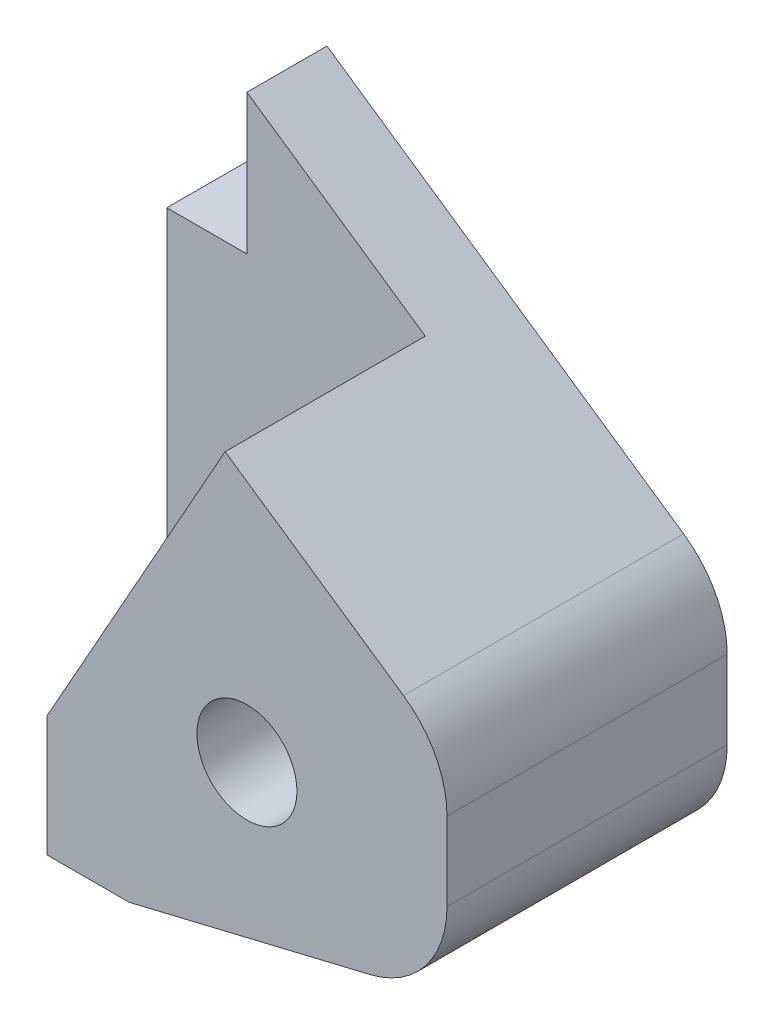
ISO-10303-21;
HEADER;
FILE_DESCRIPTION(('STEP AP214'),'2;1');
FILE_NAME('part.step','',(''),(''),'','','');
FILE_SCHEMA(('AUTOMOTIVE_DESIGN { 1 0 10303 214 1 1 1 1 }'));
ENDSEC;
DATA;
#1=APPLICATION_CONTEXT('core data for automotive mechanical design processes');
#2=APPLICATION_PROTOCOL_DEFINITION('international standard','automotive_design',2000,#1);
#3=PRODUCT_CONTEXT('',#1,'mechanical');
#4=PRODUCT('Part','Part','',(#3));
#5=PRODUCT_RELATED_PRODUCT_CATEGORY('part','',(#4));
#6=PRODUCT_DEFINITION_FORMATION('','',#4);
#7=PRODUCT_DEFINITION_CONTEXT('part definition',#1,'design');
#8=PRODUCT_DEFINITION('design','',#6,#7);
#9=PRODUCT_DEFINITION_SHAPE('','',#8);
#10=(LENGTH_UNIT() NAMED_UNIT(*) SI_UNIT(.MILLI.,.METRE.));
#11=(NAMED_UNIT(*) PLANE_ANGLE_UNIT() SI_UNIT($,.RADIAN.));
#12=(NAMED_UNIT(*) SI_UNIT($,.STERADIAN.) SOLID_ANGLE_UNIT());
#13=UNCERTAINTY_MEASURE_WITH_UNIT(LENGTH_MEASURE(1.E-05),#10,'distance_accuracy_value','');
#14=(GEOMETRIC_REPRESENTATION_CONTEXT(3) GLOBAL_UNCERTAINTY_ASSIGNED_CONTEXT((#13)) GLOBAL_UNIT_ASSIGNED_CONTEXT((#10,
#11,#12)) REPRESENTATION_CONTEXT('',''));
#15=CARTESIAN_POINT('',(0.,0.,0.));
#16=DIRECTION('',(0.,0.,1.));
#17=DIRECTION('',(1.,0.,0.));
#18=AXIS2_PLACEMENT_3D('',#15,#16,#17);
#19=CARTESIAN_POINT('',(0.,0.,4.));
#20=DIRECTION('',(0.,0.,1.));
#21=DIRECTION('',(1.,0.,0.));
#22=AXIS2_PLACEMENT_3D('',#19,#20,#21);
#23=PLANE('',#22);
#24=DIRECTION('',(-1.,0.,0.));
#25=VECTOR('',#24,1.);
#26=CARTESIAN_POINT('',(0.,0.,4.));
#27=LINE('',#26,#25);
#28=CARTESIAN_POINT('',(4.,0.,4.));
#29=VERTEX_POINT('',#28);
#30=CARTESIAN_POINT('',(0.,0.,4.));
#31=VERTEX_POINT('',#30);
#32=EDGE_CURVE('E207',#29,#31,#27,.T.);
#33=ORIENTED_EDGE('',*,*,#32,.F.);
#34=DIRECTION('',(0.48891591950143,0.872330914079096,0.));
#35=VECTOR('',#34,1.);
#36=CARTESIAN_POINT('',(3.04384489463228,-1.70598588386602,4.));
#37=LINE('',#36,#35);
#38=CARTESIAN_POINT('',(12.9119494753499,15.9008302286135,4.));
#39=VERTEX_POINT('',#38);
#40=EDGE_CURVE('E138',#29,#39,#37,.T.);
#41=ORIENTED_EDGE('',*,*,#40,.T.);
#42=DIRECTION('',(0.825241654698473,-0.56477979013995,0.));
#43=VECTOR('',#42,1.);
#44=CARTESIAN_POINT('',(11.5296606336198,16.8468425845098,4.));
#45=LINE('',#44,#43);
#46=CARTESIAN_POINT('',(4.,22.,4.));
#47=VERTEX_POINT('',#46);
#48=EDGE_CURVE('E190',#47,#39,#45,.T.);
#49=ORIENTED_EDGE('',*,*,#48,.F.);
#50=DIRECTION('',(0.,1.,0.));
#51=VECTOR('',#50,1.);
#52=CARTESIAN_POINT('',(4.,0.,4.));
#53=LINE('',#52,#51);
#54=CARTESIAN_POINT('',(4.,15.,4.));
#55=VERTEX_POINT('',#54);
#56=EDGE_CURVE('E194',#55,#47,#53,.T.);
#57=ORIENTED_EDGE('',*,*,#56,.F.);
#58=DIRECTION('',(1.,0.,0.));
#59=VECTOR('',#58,1.);
#60=CARTESIAN_POINT('',(0.,15.,4.));
#61=LINE('',#60,#59);
#62=CARTESIAN_POINT('',(0.,15.,4.));
#63=VERTEX_POINT('',#62);
#64=EDGE_CURVE('E199',#63,#55,#61,.T.);
#65=ORIENTED_EDGE('',*,*,#64,.F.);
#66=DIRECTION('',(0.,1.,0.));
#67=VECTOR('',#66,1.);
#68=CARTESIAN_POINT('',(0.,0.,4.));
#69=LINE('',#68,#67);
#70=EDGE_CURVE('E203',#31,#63,#69,.T.);
#71=ORIENTED_EDGE('',*,*,#70,.F.);
#72=EDGE_LOOP('',(#33,#41,#49,#57,#65,#71));
#73=FACE_BOUND('',#72,.T.);
#74=ADVANCED_FACE('F41',(#73),#23,.T.);
#75=CARTESIAN_POINT('',(24.,0.,4.));
#76=DIRECTION('',(1.,0.,0.));
#77=DIRECTION('',(0.,1.,0.));
#78=AXIS2_PLACEMENT_3D('',#75,#76,#77);
#79=PLANE('',#78);
#80=DIRECTION('',(0.,-1.,0.));
#81=VECTOR('',#80,1.);
#82=CARTESIAN_POINT('',(24.,0.,0.));
#83=LINE('',#82,#81);
#84=CARTESIAN_POINT('',(24.,5.67545218373454,0.));
#85=VERTEX_POINT('',#84);
#86=CARTESIAN_POINT('',(24.,1.75794758941488,0.));
#87=VERTEX_POINT('',#86);
#88=EDGE_CURVE('E215',#85,#87,#83,.T.);
#89=ORIENTED_EDGE('',*,*,#88,.F.);
#90=DIRECTION('',(0.,0.,-1.));
#91=VECTOR('',#90,1.);
#92=CARTESIAN_POINT('',(24.,5.67545218373454,4.));
#93=LINE('',#92,#91);
#94=CARTESIAN_POINT('',(24.,5.67545218373454,14.));
#95=VERTEX_POINT('',#94);
#96=EDGE_CURVE('E50',#85,#95,#93,.F.);
#97=ORIENTED_EDGE('',*,*,#96,.T.);
#98=DIRECTION('',(0.,1.,0.));
#99=VECTOR('',#98,1.);
#100=CARTESIAN_POINT('',(24.,0.,14.));
#101=LINE('',#100,#99);
#102=CARTESIAN_POINT('',(24.,1.75794758941488,14.));
#103=VERTEX_POINT('',#102);
#104=EDGE_CURVE('E175',#103,#95,#101,.T.);
#105=ORIENTED_EDGE('',*,*,#104,.F.);
#106=DIRECTION('',(0.,0.,-1.));
#107=VECTOR('',#106,1.);
#108=CARTESIAN_POINT('',(24.,1.75794758941488,0.));
#109=LINE('',#108,#107);
#110=EDGE_CURVE('E276',#103,#87,#109,.T.);
#111=ORIENTED_EDGE('',*,*,#110,.T.);
#112=EDGE_LOOP('',(#89,#97,#105,#111));
#113=FACE_BOUND('',#112,.T.);
#114=ADVANCED_FACE('F284',(#113),#79,.T.);
#115=CARTESIAN_POINT('',(11.5296606336198,16.8468425845098,4.));
#116=DIRECTION('',(0.56477979013995,0.825241654698473,0.));
#117=DIRECTION('',(-0.825241654698473,0.56477979013995,0.));
#118=AXIS2_PLACEMENT_3D('',#115,#116,#117);
#119=PLANE('',#118);
#120=ORIENTED_EDGE('',*,*,#48,.T.);
#121=DIRECTION('',(0.,0.,-1.));
#122=VECTOR('',#121,1.);
#123=CARTESIAN_POINT('',(12.9119494753499,15.9008302286135,14.));
#124=LINE('',#123,#122);
#125=CARTESIAN_POINT('',(12.9119494753499,15.9008302286135,14.));
#126=VERTEX_POINT('',#125);
#127=EDGE_CURVE('E57',#126,#39,#124,.T.);
#128=ORIENTED_EDGE('',*,*,#127,.F.);
#129=DIRECTION('',(-0.825241654698473,0.56477979013995,0.));
#130=VECTOR('',#129,1.);
#131=CARTESIAN_POINT('',(11.5296606336198,16.8468425845098,14.));
#132=LINE('',#131,#130);
#133=CARTESIAN_POINT('',(21.8238989506998,9.80166045722691,14.));
#134=VERTEX_POINT('',#133);
#135=EDGE_CURVE('E159',#134,#126,#132,.T.);
#136=ORIENTED_EDGE('',*,*,#135,.F.);
#137=DIRECTION('',(0.,0.,-1.));
#138=VECTOR('',#137,1.);
#139=CARTESIAN_POINT('',(21.8238989506998,9.80166045722691,4.));
#140=LINE('',#139,#138);
#141=CARTESIAN_POINT('',(21.8238989506998,9.80166045722691,0.));
#142=VERTEX_POINT('',#141);
#143=EDGE_CURVE('E267',#134,#142,#140,.T.);
#144=ORIENTED_EDGE('',*,*,#143,.T.);
#145=DIRECTION('',(0.825241654698473,-0.56477979013995,0.));
#146=VECTOR('',#145,1.);
#147=CARTESIAN_POINT('',(11.5296606336198,16.8468425845098,0.));
#148=LINE('',#147,#146);
#149=CARTESIAN_POINT('',(4.,22.,0.));
#150=VERTEX_POINT('',#149);
#151=EDGE_CURVE('E218',#150,#142,#148,.T.);
#152=ORIENTED_EDGE('',*,*,#151,.F.);
#153=DIRECTION('',(0.,0.,-1.));
#154=VECTOR('',#153,1.);
#155=CARTESIAN_POINT('',(4.,22.,4.));
#156=LINE('',#155,#154);
#157=EDGE_CURVE('E264',#47,#150,#156,.T.);
#158=ORIENTED_EDGE('',*,*,#157,.F.);
#159=EDGE_LOOP('',(#120,#128,#136,#144,#152,#158));
#160=FACE_BOUND('',#159,.T.);
#161=ADVANCED_FACE('F291',(#160),#119,.T.);
#162=CARTESIAN_POINT('',(4.,0.,4.));
#163=DIRECTION('',(-1.,0.,0.));
#164=DIRECTION('',(0.,0.,1.));
#165=AXIS2_PLACEMENT_3D('',#162,#163,#164);
#166=PLANE('',#165);
#167=DIRECTION('',(0.,1.,0.));
#168=VECTOR('',#167,1.);
#169=CARTESIAN_POINT('',(4.,0.,0.));
#170=LINE('',#169,#168);
#171=CARTESIAN_POINT('',(4.,15.,0.));
#172=VERTEX_POINT('',#171);
#173=EDGE_CURVE('E222',#172,#150,#170,.T.);
#174=ORIENTED_EDGE('',*,*,#173,.F.);
#175=DIRECTION('',(0.,0.,-1.));
#176=VECTOR('',#175,1.);
#177=CARTESIAN_POINT('',(4.,15.,4.));
#178=LINE('',#177,#176);
#179=EDGE_CURVE('E261',#55,#172,#178,.T.);
#180=ORIENTED_EDGE('',*,*,#179,.F.);
#181=ORIENTED_EDGE('',*,*,#56,.T.);
#182=ORIENTED_EDGE('',*,*,#157,.T.);
#183=EDGE_LOOP('',(#174,#180,#181,#182));
#184=FACE_BOUND('',#183,.T.);
#185=ADVANCED_FACE('F296',(#184),#166,.T.);
#186=CARTESIAN_POINT('',(0.,15.,4.));
#187=DIRECTION('',(0.,1.,0.));
#188=DIRECTION('',(0.,0.,1.));
#189=AXIS2_PLACEMENT_3D('',#186,#187,#188);
#190=PLANE('',#189);
#191=DIRECTION('',(1.,0.,0.));
#192=VECTOR('',#191,1.);
#193=CARTESIAN_POINT('',(0.,15.,0.));
#194=LINE('',#193,#192);
#195=CARTESIAN_POINT('',(0.,15.,0.));
#196=VERTEX_POINT('',#195);
#197=EDGE_CURVE('E226',#196,#172,#194,.T.);
#198=ORIENTED_EDGE('',*,*,#197,.F.);
#199=DIRECTION('',(0.,0.,-1.));
#200=VECTOR('',#199,1.);
#201=CARTESIAN_POINT('',(0.,15.,4.));
#202=LINE('',#201,#200);
#203=EDGE_CURVE('E258',#63,#196,#202,.T.);
#204=ORIENTED_EDGE('',*,*,#203,.F.);
#205=ORIENTED_EDGE('',*,*,#64,.T.);
#206=ORIENTED_EDGE('',*,*,#179,.T.);
#207=EDGE_LOOP('',(#198,#204,#205,#206));
#208=FACE_BOUND('',#207,.T.);
#209=ADVANCED_FACE('F346',(#208),#190,.T.);
#210=CARTESIAN_POINT('',(0.,0.,4.));
#211=DIRECTION('',(-1.,0.,0.));
#212=DIRECTION('',(0.,0.,1.));
#213=AXIS2_PLACEMENT_3D('',#210,#211,#212);
#214=PLANE('',#213);
#215=DIRECTION('',(0.,1.,0.));
#216=VECTOR('',#215,1.);
#217=CARTESIAN_POINT('',(0.,0.,0.));
#218=LINE('',#217,#216);
#219=CARTESIAN_POINT('',(0.,0.,0.));
#220=VERTEX_POINT('',#219);
#221=EDGE_CURVE('E230',#220,#196,#218,.T.);
#222=ORIENTED_EDGE('',*,*,#221,.F.);
#223=DIRECTION('',(0.,0.,-1.));
#224=VECTOR('',#223,1.);
#225=CARTESIAN_POINT('',(0.,0.,4.));
#226=LINE('',#225,#224);
#227=EDGE_CURVE('E255',#31,#220,#226,.T.);
#228=ORIENTED_EDGE('',*,*,#227,.F.);
#229=ORIENTED_EDGE('',*,*,#70,.T.);
#230=ORIENTED_EDGE('',*,*,#203,.T.);
#231=EDGE_LOOP('',(#222,#228,#229,#230));
#232=FACE_BOUND('',#231,.T.);
#233=ADVANCED_FACE('F343',(#232),#214,.T.);
#234=CARTESIAN_POINT('',(0.,0.,4.));
#235=DIRECTION('',(0.,-1.,0.));
#236=DIRECTION('',(1.,0.,0.));
#237=AXIS2_PLACEMENT_3D('',#234,#235,#236);
#238=PLANE('',#237);
#239=DIRECTION('',(-1.,0.,0.));
#240=VECTOR('',#239,1.);
#241=CARTESIAN_POINT('',(0.,0.,0.));
#242=LINE('',#241,#240);
#243=CARTESIAN_POINT('',(4.,0.,0.));
#244=VERTEX_POINT('',#243);
#245=EDGE_CURVE('E234',#244,#220,#242,.T.);
#246=ORIENTED_EDGE('',*,*,#245,.F.);
#247=DIRECTION('',(0.,0.,-1.));
#248=VECTOR('',#247,1.);
#249=CARTESIAN_POINT('',(4.,0.,4.));
#250=LINE('',#249,#248);
#251=EDGE_CURVE('E252',#29,#244,#250,.T.);
#252=ORIENTED_EDGE('',*,*,#251,.F.);
#253=ORIENTED_EDGE('',*,*,#32,.T.);
#254=ORIENTED_EDGE('',*,*,#227,.T.);
#255=EDGE_LOOP('',(#246,#252,#253,#254));
#256=FACE_BOUND('',#255,.T.);
#257=ADVANCED_FACE('F305',(#256),#238,.T.);
#258=CARTESIAN_POINT('',(4.,0.,4.));
#259=DIRECTION('',(-1.,0.,0.));
#260=DIRECTION('',(0.,0.,1.));
#261=AXIS2_PLACEMENT_3D('',#258,#259,#260);
#262=PLANE('',#261);
#263=DIRECTION('',(0.,1.,0.));
#264=VECTOR('',#263,1.);
#265=CARTESIAN_POINT('',(4.,0.,0.));
#266=LINE('',#265,#264);
#267=CARTESIAN_POINT('',(4.,-6.,0.));
#268=VERTEX_POINT('',#267);
#269=EDGE_CURVE('E238',#268,#244,#266,.T.);
#270=ORIENTED_EDGE('',*,*,#269,.F.);
#271=DIRECTION('',(0.,0.,-1.));
#272=VECTOR('',#271,1.);
#273=CARTESIAN_POINT('',(4.,-6.,4.));
#274=LINE('',#273,#272);
#275=CARTESIAN_POINT('',(4.,-6.,14.));
#276=VERTEX_POINT('',#275);
#277=EDGE_CURVE('E148',#276,#268,#274,.T.);
#278=ORIENTED_EDGE('',*,*,#277,.F.);
#279=DIRECTION('',(0.,-1.,0.));
#280=VECTOR('',#279,1.);
#281=CARTESIAN_POINT('',(4.,0.,14.));
#282=LINE('',#281,#280);
#283=CARTESIAN_POINT('',(4.,0.,14.));
#284=VERTEX_POINT('',#283);
#285=EDGE_CURVE('E145',#284,#276,#282,.T.);
#286=ORIENTED_EDGE('',*,*,#285,.F.);
#287=DIRECTION('',(0.,0.,-1.));
#288=VECTOR('',#287,1.);
#289=CARTESIAN_POINT('',(4.,0.,14.));
#290=LINE('',#289,#288);
#291=EDGE_CURVE('E133',#284,#29,#290,.T.);
#292=ORIENTED_EDGE('',*,*,#291,.T.);
#293=ORIENTED_EDGE('',*,*,#251,.T.);
#294=EDGE_LOOP('',(#270,#278,#286,#292,#293));
#295=FACE_BOUND('',#294,.T.);
#296=ADVANCED_FACE('F147',(#295),#262,.T.);
#297=CARTESIAN_POINT('',(0.,-6.,4.));
#298=DIRECTION('',(0.,-1.,0.));
#299=DIRECTION('',(1.,0.,0.));
#300=AXIS2_PLACEMENT_3D('',#297,#298,#299);
#301=PLANE('',#300);
#302=DIRECTION('',(-1.,0.,0.));
#303=VECTOR('',#302,1.);
#304=CARTESIAN_POINT('',(0.,-6.,0.));
#305=LINE('',#304,#303);
#306=CARTESIAN_POINT('',(8.11076380065098,-6.,0.));
#307=VERTEX_POINT('',#306);
#308=EDGE_CURVE('E242',#307,#268,#305,.T.);
#309=ORIENTED_EDGE('',*,*,#308,.F.);
#310=DIRECTION('',(0.,0.,-1.));
#311=VECTOR('',#310,1.);
#312=CARTESIAN_POINT('',(8.11076380065098,-6.,4.));
#313=LINE('',#312,#311);
#314=CARTESIAN_POINT('',(8.11076380065099,-6.,14.));
#315=VERTEX_POINT('',#314);
#316=EDGE_CURVE('E211',#315,#307,#313,.T.);
#317=ORIENTED_EDGE('',*,*,#316,.F.);
#318=DIRECTION('',(1.,0.,0.));
#319=VECTOR('',#318,1.);
#320=CARTESIAN_POINT('',(0.,-6.,14.));
#321=LINE('',#320,#319);
#322=EDGE_CURVE('E153',#276,#315,#321,.T.);
#323=ORIENTED_EDGE('',*,*,#322,.F.);
#324=ORIENTED_EDGE('',*,*,#277,.T.);
#325=EDGE_LOOP('',(#309,#317,#323,#324));
#326=FACE_BOUND('',#325,.T.);
#327=ADVANCED_FACE('F309',(#326),#301,.T.);
#328=CARTESIAN_POINT('',(14.,3.,4.));
#329=DIRECTION('',(0.,0.,-1.));
#330=DIRECTION('',(-1.,0.,0.));
#331=AXIS2_PLACEMENT_3D('',#328,#329,#330);
#332=CYLINDRICAL_SURFACE('',#331,2.5);
#333=CARTESIAN_POINT('',(14.,3.,0.));
#334=DIRECTION('',(0.,0.,1.));
#335=DIRECTION('',(1.,0.,0.));
#336=AXIS2_PLACEMENT_3D('',#333,#334,#335);
#337=CIRCLE('',#336,2.5);
#338=CARTESIAN_POINT('',(16.5,3.,0.));
#339=VERTEX_POINT('',#338);
#340=EDGE_CURVE('E142',#339,#339,#337,.T.);
#341=ORIENTED_EDGE('',*,*,#340,.F.);
#342=EDGE_LOOP('',(#341));
#343=FACE_BOUND('',#342,.T.);
#344=CARTESIAN_POINT('',(14.,3.,14.));
#345=DIRECTION('',(0.,0.,1.));
#346=DIRECTION('',(1.,0.,0.));
#347=AXIS2_PLACEMENT_3D('',#344,#345,#346);
#348=CIRCLE('',#347,2.5);
#349=CARTESIAN_POINT('',(16.5,3.,14.));
#350=VERTEX_POINT('',#349);
#351=EDGE_CURVE('E184',#350,#350,#348,.F.);
#352=ORIENTED_EDGE('',*,*,#351,.F.);
#353=EDGE_LOOP('',(#352));
#354=FACE_BOUND('',#353,.T.);
#355=ADVANCED_FACE('F336',(#343,#354),#332,.F.);
#356=CARTESIAN_POINT('',(1.80511260454205,-7.51468830086219,4.));
#357=DIRECTION('',(-0.233567159699266,0.972340671734973,0.));
#358=DIRECTION('',(-0.972340671734973,-0.233567159699266,0.));
#359=AXIS2_PLACEMENT_3D('',#356,#357,#358);
#360=PLANE('',#359);
#361=DIRECTION('',(0.972340671734973,0.233567159699266,0.));
#362=VECTOR('',#361,1.);
#363=CARTESIAN_POINT('',(1.80511260454205,-7.51468830086219,0.));
#364=LINE('',#363,#362);
#365=CARTESIAN_POINT('',(20.1678357984963,-3.10375576925998,0.));
#366=VERTEX_POINT('',#365);
#367=EDGE_CURVE('E195',#307,#366,#364,.T.);
#368=ORIENTED_EDGE('',*,*,#367,.T.);
#369=DIRECTION('',(0.,0.,-1.));
#370=VECTOR('',#369,1.);
#371=CARTESIAN_POINT('',(20.1678357984963,-3.10375576925998,4.));
#372=LINE('',#371,#370);
#373=CARTESIAN_POINT('',(20.1678357984963,-3.10375576925998,14.));
#374=VERTEX_POINT('',#373);
#375=EDGE_CURVE('E11',#366,#374,#372,.F.);
#376=ORIENTED_EDGE('',*,*,#375,.T.);
#377=DIRECTION('',(0.972340671734973,0.233567159699266,0.));
#378=VECTOR('',#377,1.);
#379=CARTESIAN_POINT('',(1.80511260454205,-7.51468830086219,14.));
#380=LINE('',#379,#378);
#381=EDGE_CURVE('E167',#315,#374,#380,.T.);
#382=ORIENTED_EDGE('',*,*,#381,.F.);
#383=ORIENTED_EDGE('',*,*,#316,.T.);
#384=EDGE_LOOP('',(#368,#376,#382,#383));
#385=FACE_BOUND('',#384,.T.);
#386=ADVANCED_FACE('F312',(#385),#360,.F.);
#387=CARTESIAN_POINT('',(0.,0.,0.));
#388=DIRECTION('',(0.,0.,1.));
#389=DIRECTION('',(1.,0.,0.));
#390=AXIS2_PLACEMENT_3D('',#387,#388,#389);
#391=PLANE('',#390);
#392=ORIENTED_EDGE('',*,*,#340,.T.);
#393=EDGE_LOOP('',(#392));
#394=FACE_BOUND('',#393,.T.);
#395=ORIENTED_EDGE('',*,*,#151,.T.);
#396=CARTESIAN_POINT('',(19.,5.67545218373454,0.));
#397=DIRECTION('',(0.,0.,1.));
#398=DIRECTION('',(1.,0.,0.));
#399=AXIS2_PLACEMENT_3D('',#396,#397,#398);
#400=CIRCLE('',#399,5.);
#401=EDGE_CURVE('E273',#142,#85,#400,.F.);
#402=ORIENTED_EDGE('',*,*,#401,.T.);
#403=ORIENTED_EDGE('',*,*,#88,.T.);
#404=CARTESIAN_POINT('',(19.,1.75794758941488,0.));
#405=DIRECTION('',(0.,0.,1.));
#406=DIRECTION('',(1.,0.,0.));
#407=AXIS2_PLACEMENT_3D('',#404,#405,#406);
#408=CIRCLE('',#407,5.);
#409=EDGE_CURVE('E65',#87,#366,#408,.F.);
#410=ORIENTED_EDGE('',*,*,#409,.T.);
#411=ORIENTED_EDGE('',*,*,#367,.F.);
#412=ORIENTED_EDGE('',*,*,#308,.T.);
#413=ORIENTED_EDGE('',*,*,#269,.T.);
#414=ORIENTED_EDGE('',*,*,#245,.T.);
#415=ORIENTED_EDGE('',*,*,#221,.T.);
#416=ORIENTED_EDGE('',*,*,#197,.T.);
#417=ORIENTED_EDGE('',*,*,#173,.T.);
#418=EDGE_LOOP('',(#395,#402,#403,#410,#411,#412,#413,#414,#415,#416,#417));
#419=FACE_BOUND('',#418,.T.);
#420=ADVANCED_FACE('F292',(#394,#419),#391,.F.);
#421=CARTESIAN_POINT('',(19.,5.67545218373454,4.));
#422=DIRECTION('',(0.,0.,-1.));
#423=DIRECTION('',(-1.,0.,0.));
#424=AXIS2_PLACEMENT_3D('',#421,#422,#423);
#425=CYLINDRICAL_SURFACE('',#424,5.);
#426=ORIENTED_EDGE('',*,*,#143,.F.);
#427=CARTESIAN_POINT('',(19.,5.67545218373454,14.));
#428=DIRECTION('',(0.,0.,1.));
#429=DIRECTION('',(1.,0.,0.));
#430=AXIS2_PLACEMENT_3D('',#427,#428,#429);
#431=CIRCLE('',#430,5.);
#432=EDGE_CURVE('E179',#95,#134,#431,.T.);
#433=ORIENTED_EDGE('',*,*,#432,.F.);
#434=ORIENTED_EDGE('',*,*,#96,.F.);
#435=ORIENTED_EDGE('',*,*,#401,.F.);
#436=EDGE_LOOP('',(#426,#433,#434,#435));
#437=FACE_BOUND('',#436,.T.);
#438=ADVANCED_FACE('F288',(#437),#425,.T.);
#439=CARTESIAN_POINT('',(19.,1.75794758941488,4.));
#440=DIRECTION('',(0.,0.,1.));
#441=DIRECTION('',(1.,0.,0.));
#442=AXIS2_PLACEMENT_3D('',#439,#440,#441);
#443=CYLINDRICAL_SURFACE('',#442,5.);
#444=ORIENTED_EDGE('',*,*,#110,.F.);
#445=CARTESIAN_POINT('',(19.,1.75794758941488,14.));
#446=DIRECTION('',(0.,0.,1.));
#447=DIRECTION('',(1.,0.,0.));
#448=AXIS2_PLACEMENT_3D('',#445,#446,#447);
#449=CIRCLE('',#448,5.);
#450=EDGE_CURVE('E171',#374,#103,#449,.T.);
#451=ORIENTED_EDGE('',*,*,#450,.F.);
#452=ORIENTED_EDGE('',*,*,#375,.F.);
#453=ORIENTED_EDGE('',*,*,#409,.F.);
#454=EDGE_LOOP('',(#444,#451,#452,#453));
#455=FACE_BOUND('',#454,.T.);
#456=ADVANCED_FACE('F43',(#455),#443,.T.);
#457=CARTESIAN_POINT('',(3.04384489463228,-1.70598588386602,14.));
#458=DIRECTION('',(-0.872330914079096,0.48891591950143,0.));
#459=DIRECTION('',(-0.48891591950143,-0.872330914079096,0.));
#460=AXIS2_PLACEMENT_3D('',#457,#458,#459);
#461=PLANE('',#460);
#462=ORIENTED_EDGE('',*,*,#40,.F.);
#463=ORIENTED_EDGE('',*,*,#291,.F.);
#464=DIRECTION('',(0.48891591950143,0.872330914079096,0.));
#465=VECTOR('',#464,1.);
#466=CARTESIAN_POINT('',(3.04384489463228,-1.70598588386602,14.));
#467=LINE('',#466,#465);
#468=EDGE_CURVE('E137',#284,#126,#467,.T.);
#469=ORIENTED_EDGE('',*,*,#468,.T.);
#470=ORIENTED_EDGE('',*,*,#127,.T.);
#471=EDGE_LOOP('',(#462,#463,#469,#470));
#472=FACE_BOUND('',#471,.T.);
#473=ADVANCED_FACE('F135',(#472),#461,.T.);
#474=CARTESIAN_POINT('',(0.,0.,14.));
#475=DIRECTION('',(0.,0.,1.));
#476=DIRECTION('',(1.,0.,0.));
#477=AXIS2_PLACEMENT_3D('',#474,#475,#476);
#478=PLANE('',#477);
#479=ORIENTED_EDGE('',*,*,#468,.F.);
#480=ORIENTED_EDGE('',*,*,#285,.T.);
#481=ORIENTED_EDGE('',*,*,#322,.T.);
#482=ORIENTED_EDGE('',*,*,#381,.T.);
#483=ORIENTED_EDGE('',*,*,#450,.T.);
#484=ORIENTED_EDGE('',*,*,#104,.T.);
#485=ORIENTED_EDGE('',*,*,#432,.T.);
#486=ORIENTED_EDGE('',*,*,#135,.T.);
#487=EDGE_LOOP('',(#479,#480,#481,#482,#483,#484,#485,#486));
#488=FACE_BOUND('',#487,.T.);
#489=ORIENTED_EDGE('',*,*,#351,.T.);
#490=EDGE_LOOP('',(#489));
#491=FACE_BOUND('',#490,.T.);
#492=ADVANCED_FACE('F155',(#488,#491),#478,.T.);
#493=CLOSED_SHELL('',(#74,#114,#161,#185,#209,#233,#257,#296,#327,#355,#386,#420,#438,#456,#473,#492));
#494=MANIFOLD_SOLID_BREP('B2',#493);
#495=ADVANCED_BREP_SHAPE_REPRESENTATION('',(#18,#494),#14);
#496=SHAPE_DEFINITION_REPRESENTATION(#9,#495);
ENDSEC;
END-ISO-10303-21;
